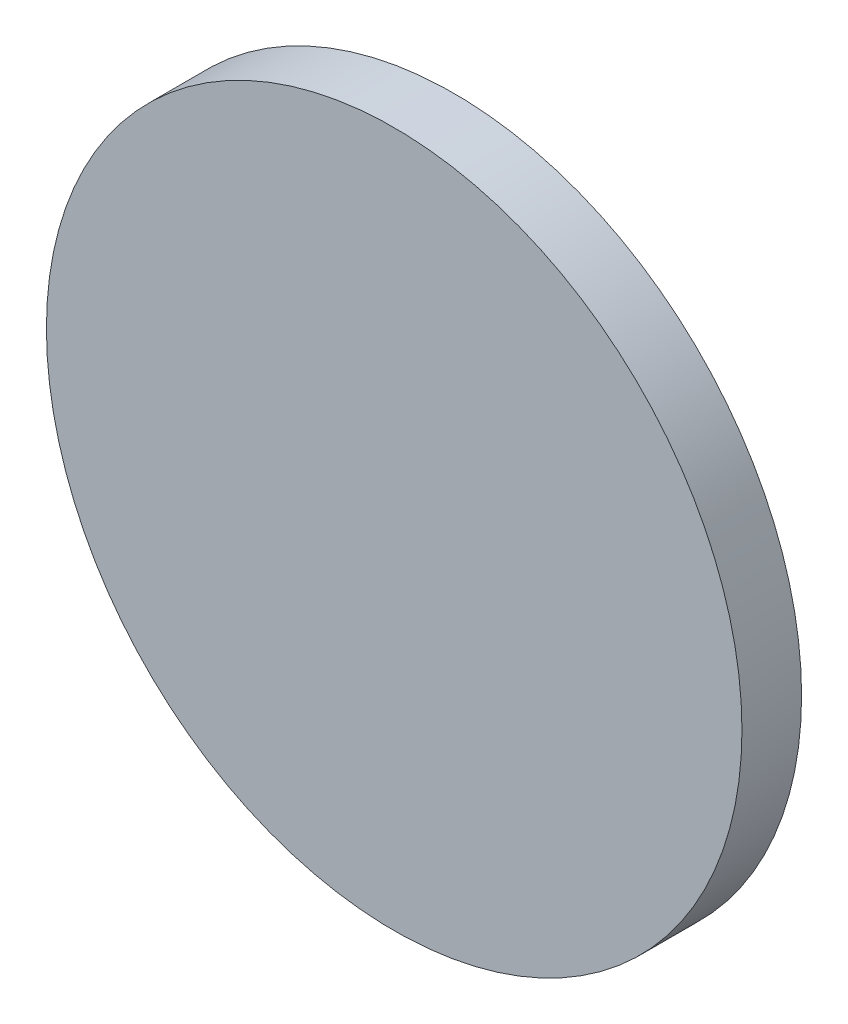
ISO-10303-21;
HEADER;
FILE_DESCRIPTION(('STEP AP214'),'2;1');
FILE_NAME('part.step','',(''),(''),'','','');
FILE_SCHEMA(('AUTOMOTIVE_DESIGN { 1 0 10303 214 1 1 1 1 }'));
ENDSEC;
DATA;
#1=APPLICATION_CONTEXT('core data for automotive mechanical design processes');
#2=APPLICATION_PROTOCOL_DEFINITION('international standard','automotive_design',2000,#1);
#3=PRODUCT_CONTEXT('',#1,'mechanical');
#4=PRODUCT('Part','Part','',(#3));
#5=PRODUCT_RELATED_PRODUCT_CATEGORY('part','',(#4));
#6=PRODUCT_DEFINITION_FORMATION('','',#4);
#7=PRODUCT_DEFINITION_CONTEXT('part definition',#1,'design');
#8=PRODUCT_DEFINITION('design','',#6,#7);
#9=PRODUCT_DEFINITION_SHAPE('','',#8);
#10=(LENGTH_UNIT() NAMED_UNIT(*) SI_UNIT(.MILLI.,.METRE.));
#11=(NAMED_UNIT(*) PLANE_ANGLE_UNIT() SI_UNIT($,.RADIAN.));
#12=(NAMED_UNIT(*) SI_UNIT($,.STERADIAN.) SOLID_ANGLE_UNIT());
#13=UNCERTAINTY_MEASURE_WITH_UNIT(LENGTH_MEASURE(1.E-05),#10,'distance_accuracy_value','');
#14=(GEOMETRIC_REPRESENTATION_CONTEXT(3) GLOBAL_UNCERTAINTY_ASSIGNED_CONTEXT((#13)) GLOBAL_UNIT_ASSIGNED_CONTEXT((#10,
#11,#12)) REPRESENTATION_CONTEXT('',''));
#15=CARTESIAN_POINT('',(0.,0.,0.));
#16=DIRECTION('',(0.,0.,1.));
#17=DIRECTION('',(1.,0.,0.));
#18=AXIS2_PLACEMENT_3D('',#15,#16,#17);
#19=CARTESIAN_POINT('',(6.72846,4.59486,0.76487));
#20=DIRECTION('',(0.,0.,-1.));
#21=DIRECTION('',(-1.,0.,0.));
#22=AXIS2_PLACEMENT_3D('',#19,#20,#21);
#23=PLANE('',#22);
#24=CARTESIAN_POINT('',(6.72846,4.59486,0.76487));
#25=DIRECTION('',(0.,0.,1.));
#26=DIRECTION('',(1.,0.,0.));
#27=AXIS2_PLACEMENT_3D('',#24,#25,#26);
#28=CIRCLE('',#27,0.200024667);
#29=CARTESIAN_POINT('',(6.928484667,4.59486,0.76487));
#30=VERTEX_POINT('',#29);
#31=EDGE_CURVE('E18',#30,#30,#28,.T.);
#32=ORIENTED_EDGE('',*,*,#31,.F.);
#33=EDGE_LOOP('',(#32));
#34=FACE_BOUND('',#33,.T.);
#35=ADVANCED_FACE('F15',(#34),#23,.T.);
#36=CARTESIAN_POINT('',(6.72846,4.59486,0.76487));
#37=DIRECTION('',(0.,0.,1.));
#38=DIRECTION('',(1.,0.,0.));
#39=AXIS2_PLACEMENT_3D('',#36,#37,#38);
#40=CYLINDRICAL_SURFACE('',#39,0.200024667);
#41=CARTESIAN_POINT('',(6.72846,4.59486,0.79916));
#42=DIRECTION('',(0.,0.,1.));
#43=DIRECTION('',(1.,0.,0.));
#44=AXIS2_PLACEMENT_3D('',#41,#42,#43);
#45=CIRCLE('',#44,0.200024667);
#46=CARTESIAN_POINT('',(6.928484667,4.59486,0.79916));
#47=VERTEX_POINT('',#46);
#48=EDGE_CURVE('E10',#47,#47,#45,.T.);
#49=ORIENTED_EDGE('',*,*,#48,.F.);
#50=EDGE_LOOP('',(#49));
#51=FACE_BOUND('',#50,.T.);
#52=ORIENTED_EDGE('',*,*,#31,.T.);
#53=EDGE_LOOP('',(#52));
#54=FACE_BOUND('',#53,.T.);
#55=ADVANCED_FACE('F27',(#51,#54),#40,.T.);
#56=CARTESIAN_POINT('',(6.72846,4.59486,0.79916));
#57=DIRECTION('',(0.,0.,1.));
#58=DIRECTION('',(1.,0.,0.));
#59=AXIS2_PLACEMENT_3D('',#56,#57,#58);
#60=PLANE('',#59);
#61=ORIENTED_EDGE('',*,*,#48,.T.);
#62=EDGE_LOOP('',(#61));
#63=FACE_BOUND('',#62,.T.);
#64=ADVANCED_FACE('F34',(#63),#60,.T.);
#65=CLOSED_SHELL('',(#35,#55,#64));
#66=MANIFOLD_SOLID_BREP('B1',#65);
#67=ADVANCED_BREP_SHAPE_REPRESENTATION('',(#18,#66),#14);
#68=SHAPE_DEFINITION_REPRESENTATION(#9,#67);
ENDSEC;
END-ISO-10303-21;
